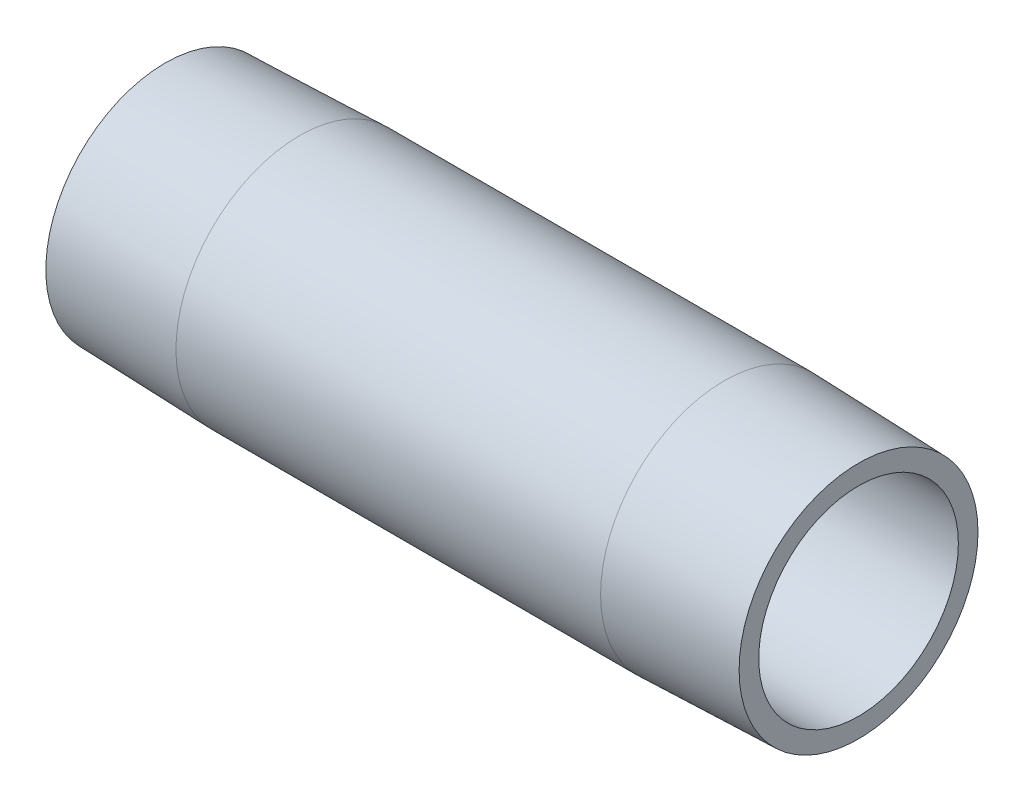
ISO-10303-21;
HEADER;
FILE_DESCRIPTION(('STEP AP214'),'2;1');
FILE_NAME('part.step','',(''),(''),'','','');
FILE_SCHEMA(('AUTOMOTIVE_DESIGN { 1 0 10303 214 1 1 1 1 }'));
ENDSEC;
DATA;
#1=APPLICATION_CONTEXT('core data for automotive mechanical design processes');
#2=APPLICATION_PROTOCOL_DEFINITION('international standard','automotive_design',2000,#1);
#3=PRODUCT_CONTEXT('',#1,'mechanical');
#4=PRODUCT('Part','Part','',(#3));
#5=PRODUCT_RELATED_PRODUCT_CATEGORY('part','',(#4));
#6=PRODUCT_DEFINITION_FORMATION('','',#4);
#7=PRODUCT_DEFINITION_CONTEXT('part definition',#1,'design');
#8=PRODUCT_DEFINITION('design','',#6,#7);
#9=PRODUCT_DEFINITION_SHAPE('','',#8);
#10=(LENGTH_UNIT() NAMED_UNIT(*) SI_UNIT(.MILLI.,.METRE.));
#11=(NAMED_UNIT(*) PLANE_ANGLE_UNIT() SI_UNIT($,.RADIAN.));
#12=(NAMED_UNIT(*) SI_UNIT($,.STERADIAN.) SOLID_ANGLE_UNIT());
#13=UNCERTAINTY_MEASURE_WITH_UNIT(LENGTH_MEASURE(1.E-05),#10,'distance_accuracy_value','');
#14=(GEOMETRIC_REPRESENTATION_CONTEXT(3) GLOBAL_UNCERTAINTY_ASSIGNED_CONTEXT((#13)) GLOBAL_UNIT_ASSIGNED_CONTEXT((#10,
#11,#12)) REPRESENTATION_CONTEXT('',''));
#15=CARTESIAN_POINT('',(0.,0.,0.));
#16=DIRECTION('',(0.,0.,1.));
#17=DIRECTION('',(1.,0.,0.));
#18=AXIS2_PLACEMENT_3D('',#15,#16,#17);
#19=CARTESIAN_POINT('',(0.,11.86134375,0.));
#20=DIRECTION('',(-1.,0.,0.));
#21=DIRECTION('',(0.,0.,1.));
#22=AXIS2_PLACEMENT_3D('',#19,#20,#21);
#23=PLANE('',#22);
#24=CARTESIAN_POINT('',(0.,0.,0.));
#25=DIRECTION('',(1.,0.,0.));
#26=DIRECTION('',(0.,0.,-1.));
#27=AXIS2_PLACEMENT_3D('',#24,#25,#26);
#28=CIRCLE('',#27,10.8);
#29=CARTESIAN_POINT('',(0.,0.,-10.8));
#30=VERTEX_POINT('',#29);
#31=EDGE_CURVE('E18',#30,#30,#28,.F.);
#32=ORIENTED_EDGE('',*,*,#31,.F.);
#33=EDGE_LOOP('',(#32));
#34=FACE_BOUND('',#33,.T.);
#35=CARTESIAN_POINT('',(-1.20959589793172E-10,0.,0.));
#36=DIRECTION('',(1.,0.,0.));
#37=DIRECTION('',(0.,1.,0.));
#38=AXIS2_PLACEMENT_3D('',#35,#36,#37);
#39=CIRCLE('',#38,12.9226875038715);
#40=CARTESIAN_POINT('',(-1.20960381053433E-10,12.9226875038715,0.));
#41=VERTEX_POINT('',#40);
#42=EDGE_CURVE('E34',#41,#41,#39,.T.);
#43=ORIENTED_EDGE('',*,*,#42,.F.);
#44=EDGE_LOOP('',(#43));
#45=FACE_BOUND('',#44,.T.);
#46=ADVANCED_FACE('F15',(#34,#45),#23,.T.);
#47=CARTESIAN_POINT('',(0.,0.,0.));
#48=DIRECTION('',(1.,0.,0.));
#49=DIRECTION('',(0.,0.,-1.));
#50=AXIS2_PLACEMENT_3D('',#47,#48,#49);
#51=CYLINDRICAL_SURFACE('',#50,10.8);
#52=ORIENTED_EDGE('',*,*,#31,.T.);
#53=EDGE_LOOP('',(#52));
#54=FACE_BOUND('',#53,.T.);
#55=CARTESIAN_POINT('',(75.,0.,0.));
#56=DIRECTION('',(1.,0.,0.));
#57=DIRECTION('',(0.,0.,-1.));
#58=AXIS2_PLACEMENT_3D('',#55,#56,#57);
#59=CIRCLE('',#58,10.8);
#60=CARTESIAN_POINT('',(75.,0.,-10.8));
#61=VERTEX_POINT('',#60);
#62=EDGE_CURVE('E31',#61,#61,#59,.F.);
#63=ORIENTED_EDGE('',*,*,#62,.F.);
#64=EDGE_LOOP('',(#63));
#65=FACE_BOUND('',#64,.T.);
#66=ADVANCED_FACE('F41',(#54,#65),#51,.F.);
#67=CARTESIAN_POINT('',(-1.21013518423881E-10,0.,0.));
#68=DIRECTION('',(1.,0.,0.));
#69=DIRECTION('',(0.,1.,0.));
#70=AXIS2_PLACEMENT_3D('',#67,#68,#69);
#71=CONICAL_SURFACE('',#70,12.9226875038715,0.0312398328973743);
#72=CARTESIAN_POINT('',(14.53,0.,0.));
#73=DIRECTION('',(1.,0.,0.));
#74=DIRECTION('',(0.,1.,0.));
#75=AXIS2_PLACEMENT_3D('',#72,#73,#74);
#76=CIRCLE('',#75,13.37675);
#77=CARTESIAN_POINT('',(14.53,13.37675,0.));
#78=VERTEX_POINT('',#77);
#79=EDGE_CURVE('E27',#78,#78,#76,.T.);
#80=ORIENTED_EDGE('',*,*,#79,.F.);
#81=EDGE_LOOP('',(#80));
#82=FACE_BOUND('',#81,.T.);
#83=ORIENTED_EDGE('',*,*,#42,.T.);
#84=EDGE_LOOP('',(#83));
#85=FACE_BOUND('',#84,.T.);
#86=ADVANCED_FACE('F50',(#82,#85),#71,.T.);
#87=CARTESIAN_POINT('',(75.,11.86134375,0.));
#88=DIRECTION('',(1.,0.,0.));
#89=DIRECTION('',(0.,0.,-1.));
#90=AXIS2_PLACEMENT_3D('',#87,#88,#89);
#91=PLANE('',#90);
#92=ORIENTED_EDGE('',*,*,#62,.T.);
#93=EDGE_LOOP('',(#92));
#94=FACE_BOUND('',#93,.T.);
#95=CARTESIAN_POINT('',(75.0000000001209,0.,0.));
#96=DIRECTION('',(-1.,0.,0.));
#97=DIRECTION('',(0.,0.,1.));
#98=AXIS2_PLACEMENT_3D('',#95,#96,#97);
#99=CIRCLE('',#98,12.9226875038715);
#100=CARTESIAN_POINT('',(75.0000000001209,0.,12.9226875038715));
#101=VERTEX_POINT('',#100);
#102=EDGE_CURVE('E22',#101,#101,#99,.T.);
#103=ORIENTED_EDGE('',*,*,#102,.F.);
#104=EDGE_LOOP('',(#103));
#105=FACE_BOUND('',#104,.T.);
#106=ADVANCED_FACE('F59',(#94,#105),#91,.T.);
#107=CARTESIAN_POINT('',(14.53,0.,0.));
#108=DIRECTION('',(1.,0.,0.));
#109=DIRECTION('',(0.,1.,0.));
#110=AXIS2_PLACEMENT_3D('',#107,#108,#109);
#111=CYLINDRICAL_SURFACE('',#110,13.37675);
#112=CARTESIAN_POINT('',(60.469999999879,0.,0.));
#113=DIRECTION('',(-1.,0.,0.));
#114=DIRECTION('',(0.,1.,0.));
#115=AXIS2_PLACEMENT_3D('',#112,#113,#114);
#116=CIRCLE('',#115,13.3767499961285);
#117=CARTESIAN_POINT('',(60.469999999879,13.3767499961285,0.));
#118=VERTEX_POINT('',#117);
#119=EDGE_CURVE('E10',#118,#118,#116,.F.);
#120=ORIENTED_EDGE('',*,*,#119,.F.);
#121=EDGE_LOOP('',(#120));
#122=FACE_BOUND('',#121,.T.);
#123=ORIENTED_EDGE('',*,*,#79,.T.);
#124=EDGE_LOOP('',(#123));
#125=FACE_BOUND('',#124,.T.);
#126=ADVANCED_FACE('F53',(#122,#125),#111,.T.);
#127=CARTESIAN_POINT('',(75.000000000121,0.,0.));
#128=DIRECTION('',(-1.,0.,0.));
#129=DIRECTION('',(0.,0.,1.));
#130=AXIS2_PLACEMENT_3D('',#127,#128,#129);
#131=CONICAL_SURFACE('',#130,12.9226875038715,0.0312398328973745);
#132=ORIENTED_EDGE('',*,*,#102,.T.);
#133=EDGE_LOOP('',(#132));
#134=FACE_BOUND('',#133,.T.);
#135=ORIENTED_EDGE('',*,*,#119,.T.);
#136=EDGE_LOOP('',(#135));
#137=FACE_BOUND('',#136,.T.);
#138=ADVANCED_FACE('F51',(#134,#137),#131,.T.);
#139=CLOSED_SHELL('',(#46,#66,#86,#106,#126,#138));
#140=MANIFOLD_SOLID_BREP('B1',#139);
#141=ADVANCED_BREP_SHAPE_REPRESENTATION('',(#18,#140),#14);
#142=SHAPE_DEFINITION_REPRESENTATION(#9,#141);
ENDSEC;
END-ISO-10303-21;
